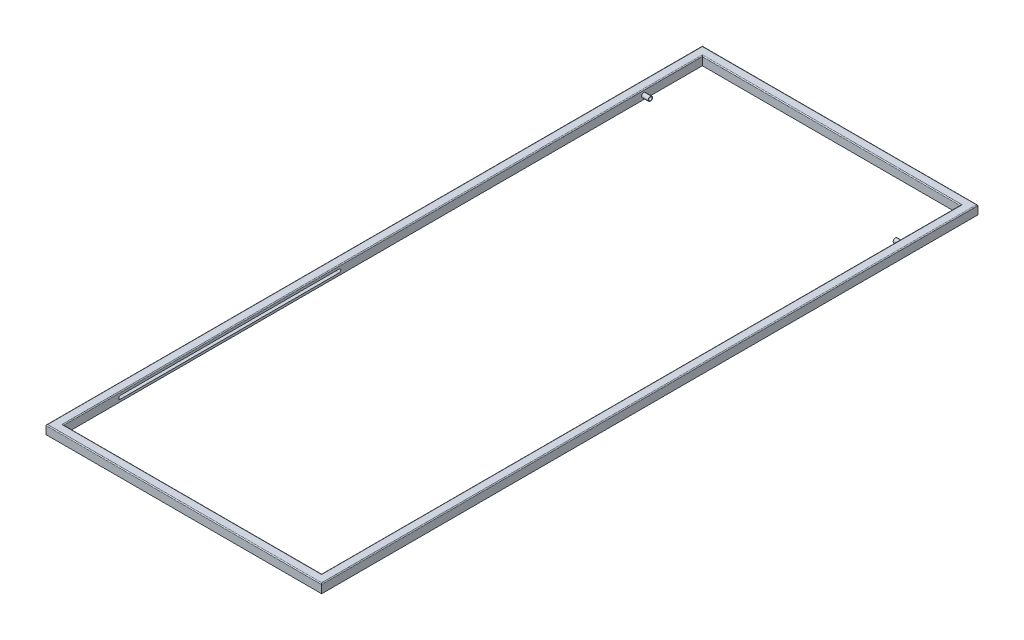
ISO-10303-21;
HEADER;
FILE_DESCRIPTION(('STEP AP214'),'2;1');
FILE_NAME('part.step','',(''),(''),'','','');
FILE_SCHEMA(('AUTOMOTIVE_DESIGN { 1 0 10303 214 1 1 1 1 }'));
ENDSEC;
DATA;
#1=APPLICATION_CONTEXT('core data for automotive mechanical design processes');
#2=APPLICATION_PROTOCOL_DEFINITION('international standard','automotive_design',2000,#1);
#3=PRODUCT_CONTEXT('',#1,'mechanical');
#4=PRODUCT('Part','Part','',(#3));
#5=PRODUCT_RELATED_PRODUCT_CATEGORY('part','',(#4));
#6=PRODUCT_DEFINITION_FORMATION('','',#4);
#7=PRODUCT_DEFINITION_CONTEXT('part definition',#1,'design');
#8=PRODUCT_DEFINITION('design','',#6,#7);
#9=PRODUCT_DEFINITION_SHAPE('','',#8);
#10=(LENGTH_UNIT() NAMED_UNIT(*) SI_UNIT(.MILLI.,.METRE.));
#11=(NAMED_UNIT(*) PLANE_ANGLE_UNIT() SI_UNIT($,.RADIAN.));
#12=(NAMED_UNIT(*) SI_UNIT($,.STERADIAN.) SOLID_ANGLE_UNIT());
#13=UNCERTAINTY_MEASURE_WITH_UNIT(LENGTH_MEASURE(1.E-05),#10,'distance_accuracy_value','');
#14=(GEOMETRIC_REPRESENTATION_CONTEXT(3) GLOBAL_UNCERTAINTY_ASSIGNED_CONTEXT((#13)) GLOBAL_UNIT_ASSIGNED_CONTEXT((#10,
#11,#12)) REPRESENTATION_CONTEXT('',''));
#15=CARTESIAN_POINT('',(0.,0.,0.));
#16=DIRECTION('',(0.,0.,1.));
#17=DIRECTION('',(1.,0.,0.));
#18=AXIS2_PLACEMENT_3D('',#15,#16,#17);
#19=CARTESIAN_POINT('',(0.,26.,0.));
#20=DIRECTION('',(0.,-1.,0.));
#21=DIRECTION('',(0.,0.,-1.));
#22=AXIS2_PLACEMENT_3D('',#19,#20,#21);
#23=PLANE('',#22);
#24=DIRECTION('',(0.,0.,1.));
#25=VECTOR('',#24,1.);
#26=CARTESIAN_POINT('',(-386.1,26.,-949.));
#27=LINE('',#26,#25);
#28=CARTESIAN_POINT('',(-386.1,26.,951.6));
#29=VERTEX_POINT('',#28);
#30=CARTESIAN_POINT('',(-386.1,26.,-951.6));
#31=VERTEX_POINT('',#30);
#32=EDGE_CURVE('E364',#29,#31,#27,.F.);
#33=ORIENTED_EDGE('',*,*,#32,.T.);
#34=DIRECTION('',(-1.,0.,0.));
#35=VECTOR('',#34,1.);
#36=CARTESIAN_POINT('',(383.5,26.,-951.6));
#37=LINE('',#36,#35);
#38=CARTESIAN_POINT('',(386.1,26.,-951.6));
#39=VERTEX_POINT('',#38);
#40=EDGE_CURVE('E373',#31,#39,#37,.F.);
#41=ORIENTED_EDGE('',*,*,#40,.T.);
#42=DIRECTION('',(0.,0.,-1.));
#43=VECTOR('',#42,1.);
#44=CARTESIAN_POINT('',(386.1,26.,949.));
#45=LINE('',#44,#43);
#46=CARTESIAN_POINT('',(386.1,26.,951.6));
#47=VERTEX_POINT('',#46);
#48=EDGE_CURVE('E370',#39,#47,#45,.F.);
#49=ORIENTED_EDGE('',*,*,#48,.T.);
#50=DIRECTION('',(1.,0.,0.));
#51=VECTOR('',#50,1.);
#52=CARTESIAN_POINT('',(-383.5,26.,951.6));
#53=LINE('',#52,#51);
#54=EDGE_CURVE('E367',#47,#29,#53,.F.);
#55=ORIENTED_EDGE('',*,*,#54,.T.);
#56=EDGE_LOOP('',(#33,#41,#49,#55));
#57=FACE_BOUND('',#56,.T.);
#58=DIRECTION('',(0.,0.,-1.));
#59=VECTOR('',#58,1.);
#60=CARTESIAN_POINT('',(406.9,26.,0.));
#61=LINE('',#60,#59);
#62=CARTESIAN_POINT('',(406.9,26.,972.4));
#63=VERTEX_POINT('',#62);
#64=CARTESIAN_POINT('',(406.9,26.,-972.4));
#65=VERTEX_POINT('',#64);
#66=EDGE_CURVE('E357',#63,#65,#61,.T.);
#67=ORIENTED_EDGE('',*,*,#66,.T.);
#68=DIRECTION('',(-1.,0.,0.));
#69=VECTOR('',#68,1.);
#70=CARTESIAN_POINT('',(0.,26.,-972.4));
#71=LINE('',#70,#69);
#72=CARTESIAN_POINT('',(-406.9,26.,-972.4));
#73=VERTEX_POINT('',#72);
#74=EDGE_CURVE('E360',#65,#73,#71,.T.);
#75=ORIENTED_EDGE('',*,*,#74,.T.);
#76=DIRECTION('',(0.,0.,1.));
#77=VECTOR('',#76,1.);
#78=CARTESIAN_POINT('',(-406.9,26.,0.));
#79=LINE('',#78,#77);
#80=CARTESIAN_POINT('',(-406.9,26.,972.4));
#81=VERTEX_POINT('',#80);
#82=EDGE_CURVE('E351',#73,#81,#79,.T.);
#83=ORIENTED_EDGE('',*,*,#82,.T.);
#84=DIRECTION('',(1.,0.,0.));
#85=VECTOR('',#84,1.);
#86=CARTESIAN_POINT('',(0.,26.,972.4));
#87=LINE('',#86,#85);
#88=EDGE_CURVE('E354',#81,#63,#87,.T.);
#89=ORIENTED_EDGE('',*,*,#88,.T.);
#90=EDGE_LOOP('',(#67,#75,#83,#89));
#91=FACE_BOUND('',#90,.T.);
#92=ADVANCED_FACE('F39',(#57,#91),#23,.F.);
#93=CARTESIAN_POINT('',(0.,0.,0.));
#94=DIRECTION('',(0.,-1.,0.));
#95=DIRECTION('',(0.,0.,-1.));
#96=AXIS2_PLACEMENT_3D('',#93,#94,#95);
#97=PLANE('',#96);
#98=CARTESIAN_POINT('',(-396.5,0.,-962.));
#99=DIRECTION('',(0.,-1.,0.));
#100=DIRECTION('',(0.,0.,1.));
#101=AXIS2_PLACEMENT_3D('',#98,#99,#100);
#102=CIRCLE('',#101,6.49999999999999);
#103=CARTESIAN_POINT('',(-396.5,0.,-955.5));
#104=VERTEX_POINT('',#103);
#105=EDGE_CURVE('E279',#104,#104,#102,.T.);
#106=ORIENTED_EDGE('',*,*,#105,.F.);
#107=EDGE_LOOP('',(#106));
#108=FACE_BOUND('',#107,.T.);
#109=CARTESIAN_POINT('',(396.5,0.,-962.));
#110=DIRECTION('',(0.,-1.,0.));
#111=DIRECTION('',(0.,0.,-1.));
#112=AXIS2_PLACEMENT_3D('',#109,#110,#111);
#113=CIRCLE('',#112,6.49999999999999);
#114=CARTESIAN_POINT('',(396.5,0.,-968.5));
#115=VERTEX_POINT('',#114);
#116=EDGE_CURVE('E271',#115,#115,#113,.T.);
#117=ORIENTED_EDGE('',*,*,#116,.F.);
#118=EDGE_LOOP('',(#117));
#119=FACE_BOUND('',#118,.T.);
#120=CARTESIAN_POINT('',(396.5,0.,962.));
#121=DIRECTION('',(0.,-1.,0.));
#122=DIRECTION('',(0.,0.,1.));
#123=AXIS2_PLACEMENT_3D('',#120,#121,#122);
#124=CIRCLE('',#123,6.49999999999999);
#125=CARTESIAN_POINT('',(396.5,0.,968.5));
#126=VERTEX_POINT('',#125);
#127=EDGE_CURVE('E263',#126,#126,#124,.T.);
#128=ORIENTED_EDGE('',*,*,#127,.F.);
#129=EDGE_LOOP('',(#128));
#130=FACE_BOUND('',#129,.T.);
#131=CARTESIAN_POINT('',(-396.5,0.,962.));
#132=DIRECTION('',(0.,-1.,0.));
#133=DIRECTION('',(0.,0.,-1.));
#134=AXIS2_PLACEMENT_3D('',#131,#132,#133);
#135=CIRCLE('',#134,6.49999999999999);
#136=CARTESIAN_POINT('',(-396.5,0.,955.5));
#137=VERTEX_POINT('',#136);
#138=EDGE_CURVE('E262',#137,#137,#135,.T.);
#139=ORIENTED_EDGE('',*,*,#138,.F.);
#140=EDGE_LOOP('',(#139));
#141=FACE_BOUND('',#140,.T.);
#142=DIRECTION('',(0.,0.,-1.));
#143=VECTOR('',#142,1.);
#144=CARTESIAN_POINT('',(409.5,0.,975.));
#145=LINE('',#144,#143);
#146=CARTESIAN_POINT('',(409.5,0.,975.));
#147=VERTEX_POINT('',#146);
#148=CARTESIAN_POINT('',(409.5,0.,-975.));
#149=VERTEX_POINT('',#148);
#150=EDGE_CURVE('E319',#147,#149,#145,.T.);
#151=ORIENTED_EDGE('',*,*,#150,.F.);
#152=DIRECTION('',(1.,0.,0.));
#153=VECTOR('',#152,1.);
#154=CARTESIAN_POINT('',(-409.5,0.,975.));
#155=LINE('',#154,#153);
#156=CARTESIAN_POINT('',(-409.5,0.,975.));
#157=VERTEX_POINT('',#156);
#158=EDGE_CURVE('E331',#157,#147,#155,.T.);
#159=ORIENTED_EDGE('',*,*,#158,.F.);
#160=DIRECTION('',(0.,0.,1.));
#161=VECTOR('',#160,1.);
#162=CARTESIAN_POINT('',(-409.5,0.,975.));
#163=LINE('',#162,#161);
#164=CARTESIAN_POINT('',(-409.5,0.,-975.));
#165=VERTEX_POINT('',#164);
#166=EDGE_CURVE('E327',#165,#157,#163,.T.);
#167=ORIENTED_EDGE('',*,*,#166,.F.);
#168=DIRECTION('',(-1.,0.,0.));
#169=VECTOR('',#168,1.);
#170=CARTESIAN_POINT('',(-409.5,0.,-975.));
#171=LINE('',#170,#169);
#172=EDGE_CURVE('E323',#149,#165,#171,.T.);
#173=ORIENTED_EDGE('',*,*,#172,.F.);
#174=EDGE_LOOP('',(#151,#159,#167,#173));
#175=FACE_BOUND('',#174,.T.);
#176=DIRECTION('',(1.,0.,0.));
#177=VECTOR('',#176,1.);
#178=CARTESIAN_POINT('',(-383.5,0.,949.));
#179=LINE('',#178,#177);
#180=CARTESIAN_POINT('',(-383.5,0.,949.));
#181=VERTEX_POINT('',#180);
#182=CARTESIAN_POINT('',(383.5,0.,949.));
#183=VERTEX_POINT('',#182);
#184=EDGE_CURVE('E303',#181,#183,#179,.T.);
#185=ORIENTED_EDGE('',*,*,#184,.T.);
#186=DIRECTION('',(0.,0.,-1.));
#187=VECTOR('',#186,1.);
#188=CARTESIAN_POINT('',(383.5,0.,949.));
#189=LINE('',#188,#187);
#190=CARTESIAN_POINT('',(383.5,0.,-949.));
#191=VERTEX_POINT('',#190);
#192=EDGE_CURVE('E288',#183,#191,#189,.T.);
#193=ORIENTED_EDGE('',*,*,#192,.T.);
#194=DIRECTION('',(-1.,0.,0.));
#195=VECTOR('',#194,1.);
#196=CARTESIAN_POINT('',(-383.5,0.,-949.));
#197=LINE('',#196,#195);
#198=CARTESIAN_POINT('',(-383.5,0.,-949.));
#199=VERTEX_POINT('',#198);
#200=EDGE_CURVE('E295',#191,#199,#197,.T.);
#201=ORIENTED_EDGE('',*,*,#200,.T.);
#202=DIRECTION('',(0.,0.,1.));
#203=VECTOR('',#202,1.);
#204=CARTESIAN_POINT('',(-383.5,0.,949.));
#205=LINE('',#204,#203);
#206=EDGE_CURVE('E299',#199,#181,#205,.T.);
#207=ORIENTED_EDGE('',*,*,#206,.T.);
#208=EDGE_LOOP('',(#185,#193,#201,#207));
#209=FACE_BOUND('',#208,.T.);
#210=ADVANCED_FACE('F466',(#108,#119,#130,#141,#175,#209),#97,.T.);
#211=CARTESIAN_POINT('',(409.5,26.,975.));
#212=DIRECTION('',(-1.,0.,0.));
#213=DIRECTION('',(0.,0.,1.));
#214=AXIS2_PLACEMENT_3D('',#211,#212,#213);
#215=PLANE('',#214);
#216=DIRECTION('',(0.,-1.,0.));
#217=VECTOR('',#216,1.);
#218=CARTESIAN_POINT('',(409.5,26.,-975.));
#219=LINE('',#218,#217);
#220=CARTESIAN_POINT('',(409.5,23.4,-975.));
#221=VERTEX_POINT('',#220);
#222=EDGE_CURVE('E344',#221,#149,#219,.T.);
#223=ORIENTED_EDGE('',*,*,#222,.F.);
#224=DIRECTION('',(0.,0.,-1.));
#225=VECTOR('',#224,1.);
#226=CARTESIAN_POINT('',(409.5,23.4,975.));
#227=LINE('',#226,#225);
#228=CARTESIAN_POINT('',(409.5,23.4,975.));
#229=VERTEX_POINT('',#228);
#230=EDGE_CURVE('E384',#221,#229,#227,.F.);
#231=ORIENTED_EDGE('',*,*,#230,.T.);
#232=DIRECTION('',(0.,-1.,0.));
#233=VECTOR('',#232,1.);
#234=CARTESIAN_POINT('',(409.5,26.,975.));
#235=LINE('',#234,#233);
#236=EDGE_CURVE('E335',#229,#147,#235,.T.);
#237=ORIENTED_EDGE('',*,*,#236,.T.);
#238=ORIENTED_EDGE('',*,*,#150,.T.);
#239=EDGE_LOOP('',(#223,#231,#237,#238));
#240=FACE_BOUND('',#239,.T.);
#241=ADVANCED_FACE('F471',(#240),#215,.F.);
#242=CARTESIAN_POINT('',(-409.5,26.,-975.));
#243=DIRECTION('',(0.,0.,1.));
#244=DIRECTION('',(1.,0.,0.));
#245=AXIS2_PLACEMENT_3D('',#242,#243,#244);
#246=PLANE('',#245);
#247=DIRECTION('',(0.,-1.,0.));
#248=VECTOR('',#247,1.);
#249=CARTESIAN_POINT('',(-409.5,26.,-975.));
#250=LINE('',#249,#248);
#251=CARTESIAN_POINT('',(-409.5,23.4,-975.));
#252=VERTEX_POINT('',#251);
#253=EDGE_CURVE('E341',#252,#165,#250,.T.);
#254=ORIENTED_EDGE('',*,*,#253,.F.);
#255=DIRECTION('',(-1.,0.,0.));
#256=VECTOR('',#255,1.);
#257=CARTESIAN_POINT('',(-409.5,23.4,-975.));
#258=LINE('',#257,#256);
#259=EDGE_CURVE('E377',#252,#221,#258,.F.);
#260=ORIENTED_EDGE('',*,*,#259,.T.);
#261=ORIENTED_EDGE('',*,*,#222,.T.);
#262=ORIENTED_EDGE('',*,*,#172,.T.);
#263=EDGE_LOOP('',(#254,#260,#261,#262));
#264=FACE_BOUND('',#263,.T.);
#265=ADVANCED_FACE('F482',(#264),#246,.F.);
#266=CARTESIAN_POINT('',(-409.5,26.,975.));
#267=DIRECTION('',(1.,0.,0.));
#268=DIRECTION('',(0.,0.,-1.));
#269=AXIS2_PLACEMENT_3D('',#266,#267,#268);
#270=PLANE('',#269);
#271=DIRECTION('',(0.,-1.,0.));
#272=VECTOR('',#271,1.);
#273=CARTESIAN_POINT('',(-409.5,26.,975.));
#274=LINE('',#273,#272);
#275=CARTESIAN_POINT('',(-409.5,23.4,975.));
#276=VERTEX_POINT('',#275);
#277=EDGE_CURVE('E338',#276,#157,#274,.T.);
#278=ORIENTED_EDGE('',*,*,#277,.F.);
#279=DIRECTION('',(0.,0.,1.));
#280=VECTOR('',#279,1.);
#281=CARTESIAN_POINT('',(-409.5,23.4,975.));
#282=LINE('',#281,#280);
#283=EDGE_CURVE('E396',#276,#252,#282,.F.);
#284=ORIENTED_EDGE('',*,*,#283,.T.);
#285=ORIENTED_EDGE('',*,*,#253,.T.);
#286=ORIENTED_EDGE('',*,*,#166,.T.);
#287=EDGE_LOOP('',(#278,#284,#285,#286));
#288=FACE_BOUND('',#287,.T.);
#289=ADVANCED_FACE('F478',(#288),#270,.F.);
#290=CARTESIAN_POINT('',(-409.5,26.,975.));
#291=DIRECTION('',(0.,0.,-1.));
#292=DIRECTION('',(-1.,0.,0.));
#293=AXIS2_PLACEMENT_3D('',#290,#291,#292);
#294=PLANE('',#293);
#295=ORIENTED_EDGE('',*,*,#236,.F.);
#296=DIRECTION('',(1.,0.,0.));
#297=VECTOR('',#296,1.);
#298=CARTESIAN_POINT('',(-409.5,23.4,975.));
#299=LINE('',#298,#297);
#300=EDGE_CURVE('E390',#229,#276,#299,.F.);
#301=ORIENTED_EDGE('',*,*,#300,.T.);
#302=ORIENTED_EDGE('',*,*,#277,.T.);
#303=ORIENTED_EDGE('',*,*,#158,.T.);
#304=EDGE_LOOP('',(#295,#301,#302,#303));
#305=FACE_BOUND('',#304,.T.);
#306=ADVANCED_FACE('F463',(#305),#294,.F.);
#307=CARTESIAN_POINT('',(383.5,26.,949.));
#308=DIRECTION('',(-1.,0.,0.));
#309=DIRECTION('',(0.,0.,1.));
#310=AXIS2_PLACEMENT_3D('',#307,#308,#309);
#311=PLANE('',#310);
#312=CARTESIAN_POINT('',(383.5,11.7,-775.125));
#313=DIRECTION('',(-1.,0.,0.));
#314=DIRECTION('',(0.,0.,1.));
#315=AXIS2_PLACEMENT_3D('',#312,#313,#314);
#316=CIRCLE('',#315,6.50000000000006);
#317=CARTESIAN_POINT('',(383.5,11.7,-768.625));
#318=VERTEX_POINT('',#317);
#319=EDGE_CURVE('E210',#318,#318,#316,.T.);
#320=ORIENTED_EDGE('',*,*,#319,.F.);
#321=EDGE_LOOP('',(#320));
#322=FACE_BOUND('',#321,.T.);
#323=CARTESIAN_POINT('',(383.5,11.7,780.));
#324=DIRECTION('',(-1.,0.,0.));
#325=DIRECTION('',(0.,0.,1.));
#326=AXIS2_PLACEMENT_3D('',#323,#324,#325);
#327=CIRCLE('',#326,4.875);
#328=CARTESIAN_POINT('',(383.5,6.825,780.));
#329=VERTEX_POINT('',#328);
#330=CARTESIAN_POINT('',(383.5,16.575,780.));
#331=VERTEX_POINT('',#330);
#332=EDGE_CURVE('E185',#329,#331,#327,.T.);
#333=ORIENTED_EDGE('',*,*,#332,.F.);
#334=DIRECTION('',(0.,0.,-1.));
#335=VECTOR('',#334,1.);
#336=CARTESIAN_POINT('',(383.5,6.825,949.));
#337=LINE('',#336,#335);
#338=CARTESIAN_POINT('',(383.5,6.825,130.));
#339=VERTEX_POINT('',#338);
#340=EDGE_CURVE('E244',#329,#339,#337,.T.);
#341=ORIENTED_EDGE('',*,*,#340,.T.);
#342=CARTESIAN_POINT('',(383.5,11.6999999999999,130.));
#343=DIRECTION('',(-1.,0.,0.));
#344=DIRECTION('',(0.,0.,1.));
#345=AXIS2_PLACEMENT_3D('',#342,#343,#344);
#346=CIRCLE('',#345,4.875);
#347=CARTESIAN_POINT('',(383.5,16.575,130.));
#348=VERTEX_POINT('',#347);
#349=EDGE_CURVE('E248',#339,#348,#346,.F.);
#350=ORIENTED_EDGE('',*,*,#349,.T.);
#351=DIRECTION('',(0.,0.,-1.));
#352=VECTOR('',#351,1.);
#353=CARTESIAN_POINT('',(383.5,16.575,949.));
#354=LINE('',#353,#352);
#355=EDGE_CURVE('E252',#331,#348,#354,.T.);
#356=ORIENTED_EDGE('',*,*,#355,.F.);
#357=EDGE_LOOP('',(#333,#341,#350,#356));
#358=FACE_BOUND('',#357,.T.);
#359=DIRECTION('',(0.,-1.,0.));
#360=VECTOR('',#359,1.);
#361=CARTESIAN_POINT('',(383.5,26.,949.));
#362=LINE('',#361,#360);
#363=CARTESIAN_POINT('',(383.5,23.4,949.));
#364=VERTEX_POINT('',#363);
#365=EDGE_CURVE('E307',#364,#183,#362,.T.);
#366=ORIENTED_EDGE('',*,*,#365,.F.);
#367=DIRECTION('',(0.,0.,-1.));
#368=VECTOR('',#367,1.);
#369=CARTESIAN_POINT('',(383.5,23.4,-949.));
#370=LINE('',#369,#368);
#371=CARTESIAN_POINT('',(383.5,23.4,-949.));
#372=VERTEX_POINT('',#371);
#373=EDGE_CURVE('E381',#364,#372,#370,.T.);
#374=ORIENTED_EDGE('',*,*,#373,.T.);
#375=DIRECTION('',(0.,-1.,0.));
#376=VECTOR('',#375,1.);
#377=CARTESIAN_POINT('',(383.5,26.,-949.));
#378=LINE('',#377,#376);
#379=EDGE_CURVE('E316',#372,#191,#378,.T.);
#380=ORIENTED_EDGE('',*,*,#379,.T.);
#381=ORIENTED_EDGE('',*,*,#192,.F.);
#382=EDGE_LOOP('',(#366,#374,#380,#381));
#383=FACE_BOUND('',#382,.T.);
#384=ADVANCED_FACE('F448',(#322,#358,#383),#311,.T.);
#385=CARTESIAN_POINT('',(-383.5,26.,-949.));
#386=DIRECTION('',(0.,0.,1.));
#387=DIRECTION('',(1.,0.,0.));
#388=AXIS2_PLACEMENT_3D('',#385,#386,#387);
#389=PLANE('',#388);
#390=ORIENTED_EDGE('',*,*,#379,.F.);
#391=DIRECTION('',(-1.,0.,0.));
#392=VECTOR('',#391,1.);
#393=CARTESIAN_POINT('',(-383.5,23.4,-949.));
#394=LINE('',#393,#392);
#395=CARTESIAN_POINT('',(-383.5,23.4,-949.));
#396=VERTEX_POINT('',#395);
#397=EDGE_CURVE('E347',#372,#396,#394,.T.);
#398=ORIENTED_EDGE('',*,*,#397,.T.);
#399=DIRECTION('',(0.,-1.,0.));
#400=VECTOR('',#399,1.);
#401=CARTESIAN_POINT('',(-383.5,26.,-949.));
#402=LINE('',#401,#400);
#403=EDGE_CURVE('E313',#396,#199,#402,.T.);
#404=ORIENTED_EDGE('',*,*,#403,.T.);
#405=ORIENTED_EDGE('',*,*,#200,.F.);
#406=EDGE_LOOP('',(#390,#398,#404,#405));
#407=FACE_BOUND('',#406,.T.);
#408=ADVANCED_FACE('F462',(#407),#389,.T.);
#409=CARTESIAN_POINT('',(-383.5,26.,949.));
#410=DIRECTION('',(1.,0.,0.));
#411=DIRECTION('',(0.,0.,-1.));
#412=AXIS2_PLACEMENT_3D('',#409,#410,#411);
#413=PLANE('',#412);
#414=CARTESIAN_POINT('',(-383.5,11.7,-775.125));
#415=DIRECTION('',(1.,0.,0.));
#416=DIRECTION('',(0.,0.,-1.));
#417=AXIS2_PLACEMENT_3D('',#414,#415,#416);
#418=CIRCLE('',#417,6.50000000000006);
#419=CARTESIAN_POINT('',(-383.5,11.7,-781.625));
#420=VERTEX_POINT('',#419);
#421=EDGE_CURVE('E11',#420,#420,#418,.T.);
#422=ORIENTED_EDGE('',*,*,#421,.F.);
#423=EDGE_LOOP('',(#422));
#424=FACE_BOUND('',#423,.T.);
#425=CARTESIAN_POINT('',(-383.5,11.7,780.));
#426=DIRECTION('',(1.,0.,0.));
#427=DIRECTION('',(0.,0.,-1.));
#428=AXIS2_PLACEMENT_3D('',#425,#426,#427);
#429=CIRCLE('',#428,4.875);
#430=CARTESIAN_POINT('',(-383.5,16.575,780.));
#431=VERTEX_POINT('',#430);
#432=CARTESIAN_POINT('',(-383.5,6.825,780.));
#433=VERTEX_POINT('',#432);
#434=EDGE_CURVE('E436',#431,#433,#429,.T.);
#435=ORIENTED_EDGE('',*,*,#434,.F.);
#436=DIRECTION('',(0.,0.,1.));
#437=VECTOR('',#436,1.);
#438=CARTESIAN_POINT('',(-383.5,16.575,949.));
#439=LINE('',#438,#437);
#440=CARTESIAN_POINT('',(-383.5,16.575,130.));
#441=VERTEX_POINT('',#440);
#442=EDGE_CURVE('E433',#441,#431,#439,.T.);
#443=ORIENTED_EDGE('',*,*,#442,.F.);
#444=CARTESIAN_POINT('',(-383.5,11.6999999999999,130.));
#445=DIRECTION('',(1.,0.,0.));
#446=DIRECTION('',(0.,0.,-1.));
#447=AXIS2_PLACEMENT_3D('',#444,#445,#446);
#448=CIRCLE('',#447,4.875);
#449=CARTESIAN_POINT('',(-383.5,6.825,130.));
#450=VERTEX_POINT('',#449);
#451=EDGE_CURVE('E429',#441,#450,#448,.F.);
#452=ORIENTED_EDGE('',*,*,#451,.T.);
#453=DIRECTION('',(0.,0.,1.));
#454=VECTOR('',#453,1.);
#455=CARTESIAN_POINT('',(-383.5,6.825,949.));
#456=LINE('',#455,#454);
#457=EDGE_CURVE('E399',#450,#433,#456,.T.);
#458=ORIENTED_EDGE('',*,*,#457,.T.);
#459=EDGE_LOOP('',(#435,#443,#452,#458));
#460=FACE_BOUND('',#459,.T.);
#461=ORIENTED_EDGE('',*,*,#403,.F.);
#462=DIRECTION('',(0.,0.,1.));
#463=VECTOR('',#462,1.);
#464=CARTESIAN_POINT('',(-383.5,23.4,949.));
#465=LINE('',#464,#463);
#466=CARTESIAN_POINT('',(-383.5,23.4,949.));
#467=VERTEX_POINT('',#466);
#468=EDGE_CURVE('E393',#396,#467,#465,.T.);
#469=ORIENTED_EDGE('',*,*,#468,.T.);
#470=DIRECTION('',(0.,-1.,0.));
#471=VECTOR('',#470,1.);
#472=CARTESIAN_POINT('',(-383.5,26.,949.));
#473=LINE('',#472,#471);
#474=EDGE_CURVE('E310',#467,#181,#473,.T.);
#475=ORIENTED_EDGE('',*,*,#474,.T.);
#476=ORIENTED_EDGE('',*,*,#206,.F.);
#477=EDGE_LOOP('',(#461,#469,#475,#476));
#478=FACE_BOUND('',#477,.T.);
#479=ADVANCED_FACE('F562',(#424,#460,#478),#413,.T.);
#480=CARTESIAN_POINT('',(-383.5,26.,949.));
#481=DIRECTION('',(0.,0.,-1.));
#482=DIRECTION('',(-1.,0.,0.));
#483=AXIS2_PLACEMENT_3D('',#480,#481,#482);
#484=PLANE('',#483);
#485=ORIENTED_EDGE('',*,*,#474,.F.);
#486=DIRECTION('',(1.,0.,0.));
#487=VECTOR('',#486,1.);
#488=CARTESIAN_POINT('',(383.5,23.4,949.));
#489=LINE('',#488,#487);
#490=EDGE_CURVE('E387',#467,#364,#489,.T.);
#491=ORIENTED_EDGE('',*,*,#490,.T.);
#492=ORIENTED_EDGE('',*,*,#365,.T.);
#493=ORIENTED_EDGE('',*,*,#184,.F.);
#494=EDGE_LOOP('',(#485,#491,#492,#493));
#495=FACE_BOUND('',#494,.T.);
#496=ADVANCED_FACE('F549',(#495),#484,.T.);
#497=CARTESIAN_POINT('',(-396.5,19.5,962.));
#498=DIRECTION('',(0.,-1.,0.));
#499=DIRECTION('',(0.,0.,-1.));
#500=AXIS2_PLACEMENT_3D('',#497,#498,#499);
#501=CYLINDRICAL_SURFACE('',#500,6.49999999999999);
#502=CARTESIAN_POINT('',(-396.5,19.5,962.));
#503=DIRECTION('',(0.,-1.,0.));
#504=DIRECTION('',(0.,0.,-1.));
#505=AXIS2_PLACEMENT_3D('',#502,#503,#504);
#506=CIRCLE('',#505,6.49999999999999);
#507=CARTESIAN_POINT('',(-396.5,19.5,955.5));
#508=VERTEX_POINT('',#507);
#509=EDGE_CURVE('E284',#508,#508,#506,.T.);
#510=ORIENTED_EDGE('',*,*,#509,.F.);
#511=EDGE_LOOP('',(#510));
#512=FACE_BOUND('',#511,.T.);
#513=ORIENTED_EDGE('',*,*,#138,.T.);
#514=EDGE_LOOP('',(#513));
#515=FACE_BOUND('',#514,.T.);
#516=ADVANCED_FACE('F578',(#512,#515),#501,.F.);
#517=CARTESIAN_POINT('',(-396.5,19.5,962.));
#518=DIRECTION('',(0.,-1.,0.));
#519=DIRECTION('',(0.,0.,-1.));
#520=AXIS2_PLACEMENT_3D('',#517,#518,#519);
#521=PLANE('',#520);
#522=ORIENTED_EDGE('',*,*,#509,.T.);
#523=EDGE_LOOP('',(#522));
#524=FACE_BOUND('',#523,.T.);
#525=ADVANCED_FACE('F671',(#524),#521,.T.);
#526=CARTESIAN_POINT('',(396.5,19.5,962.));
#527=DIRECTION('',(0.,-1.,0.));
#528=DIRECTION('',(0.,0.,-1.));
#529=AXIS2_PLACEMENT_3D('',#526,#527,#528);
#530=CYLINDRICAL_SURFACE('',#529,6.49999999999999);
#531=CARTESIAN_POINT('',(396.5,19.5,962.));
#532=DIRECTION('',(0.,-1.,0.));
#533=DIRECTION('',(0.,0.,1.));
#534=AXIS2_PLACEMENT_3D('',#531,#532,#533);
#535=CIRCLE('',#534,6.49999999999999);
#536=CARTESIAN_POINT('',(396.5,19.5,968.5));
#537=VERTEX_POINT('',#536);
#538=EDGE_CURVE('E258',#537,#537,#535,.T.);
#539=ORIENTED_EDGE('',*,*,#538,.F.);
#540=EDGE_LOOP('',(#539));
#541=FACE_BOUND('',#540,.T.);
#542=ORIENTED_EDGE('',*,*,#127,.T.);
#543=EDGE_LOOP('',(#542));
#544=FACE_BOUND('',#543,.T.);
#545=ADVANCED_FACE('F667',(#541,#544),#530,.F.);
#546=CARTESIAN_POINT('',(396.5,19.5,962.));
#547=DIRECTION('',(0.,1.,0.));
#548=DIRECTION('',(0.,0.,1.));
#549=AXIS2_PLACEMENT_3D('',#546,#547,#548);
#550=PLANE('',#549);
#551=ORIENTED_EDGE('',*,*,#538,.T.);
#552=EDGE_LOOP('',(#551));
#553=FACE_BOUND('',#552,.T.);
#554=ADVANCED_FACE('F663',(#553),#550,.F.);
#555=CARTESIAN_POINT('',(396.5,19.5,-962.));
#556=DIRECTION('',(0.,-1.,0.));
#557=DIRECTION('',(0.,0.,-1.));
#558=AXIS2_PLACEMENT_3D('',#555,#556,#557);
#559=CYLINDRICAL_SURFACE('',#558,6.49999999999999);
#560=CARTESIAN_POINT('',(396.5,19.5,-962.));
#561=DIRECTION('',(0.,-1.,0.));
#562=DIRECTION('',(0.,0.,-1.));
#563=AXIS2_PLACEMENT_3D('',#560,#561,#562);
#564=CIRCLE('',#563,6.49999999999999);
#565=CARTESIAN_POINT('',(396.5,19.5,-968.5));
#566=VERTEX_POINT('',#565);
#567=EDGE_CURVE('E267',#566,#566,#564,.T.);
#568=ORIENTED_EDGE('',*,*,#567,.F.);
#569=EDGE_LOOP('',(#568));
#570=FACE_BOUND('',#569,.T.);
#571=ORIENTED_EDGE('',*,*,#116,.T.);
#572=EDGE_LOOP('',(#571));
#573=FACE_BOUND('',#572,.T.);
#574=ADVANCED_FACE('F666',(#570,#573),#559,.F.);
#575=CARTESIAN_POINT('',(396.5,19.5,-962.));
#576=DIRECTION('',(0.,-1.,0.));
#577=DIRECTION('',(0.,0.,-1.));
#578=AXIS2_PLACEMENT_3D('',#575,#576,#577);
#579=PLANE('',#578);
#580=ORIENTED_EDGE('',*,*,#567,.T.);
#581=EDGE_LOOP('',(#580));
#582=FACE_BOUND('',#581,.T.);
#583=ADVANCED_FACE('F673',(#582),#579,.T.);
#584=CARTESIAN_POINT('',(-396.5,19.5,-962.));
#585=DIRECTION('',(0.,-1.,0.));
#586=DIRECTION('',(0.,0.,-1.));
#587=AXIS2_PLACEMENT_3D('',#584,#585,#586);
#588=CYLINDRICAL_SURFACE('',#587,6.49999999999999);
#589=CARTESIAN_POINT('',(-396.5,19.5,-962.));
#590=DIRECTION('',(0.,-1.,0.));
#591=DIRECTION('',(0.,0.,1.));
#592=AXIS2_PLACEMENT_3D('',#589,#590,#591);
#593=CIRCLE('',#592,6.49999999999999);
#594=CARTESIAN_POINT('',(-396.5,19.5,-955.5));
#595=VERTEX_POINT('',#594);
#596=EDGE_CURVE('E275',#595,#595,#593,.T.);
#597=ORIENTED_EDGE('',*,*,#596,.F.);
#598=EDGE_LOOP('',(#597));
#599=FACE_BOUND('',#598,.T.);
#600=ORIENTED_EDGE('',*,*,#105,.T.);
#601=EDGE_LOOP('',(#600));
#602=FACE_BOUND('',#601,.T.);
#603=ADVANCED_FACE('F676',(#599,#602),#588,.F.);
#604=CARTESIAN_POINT('',(-396.5,19.5,-962.));
#605=DIRECTION('',(0.,1.,0.));
#606=DIRECTION('',(0.,0.,1.));
#607=AXIS2_PLACEMENT_3D('',#604,#605,#606);
#608=PLANE('',#607);
#609=ORIENTED_EDGE('',*,*,#596,.T.);
#610=EDGE_LOOP('',(#609));
#611=FACE_BOUND('',#610,.T.);
#612=ADVANCED_FACE('F505',(#611),#608,.F.);
#613=CARTESIAN_POINT('',(-383.5,23.4,951.6));
#614=DIRECTION('',(-1.,0.,0.));
#615=DIRECTION('',(0.,0.,1.));
#616=AXIS2_PLACEMENT_3D('',#613,#614,#615);
#617=CYLINDRICAL_SURFACE('',#616,2.6);
#618=CARTESIAN_POINT('',(-386.1,23.4,951.6));
#619=DIRECTION('',(-0.707106781186547,0.,-0.707106781186547));
#620=DIRECTION('',(-0.707106781186547,0.,0.707106781186547));
#621=AXIS2_PLACEMENT_3D('',#618,#619,#620);
#622=ELLIPSE('',#621,3.67695526217005,2.6);
#623=EDGE_CURVE('E407',#29,#467,#622,.T.);
#624=ORIENTED_EDGE('',*,*,#623,.F.);
#625=ORIENTED_EDGE('',*,*,#54,.F.);
#626=CARTESIAN_POINT('',(386.1,23.4,951.6));
#627=DIRECTION('',(-0.707106781186547,0.,0.707106781186547));
#628=DIRECTION('',(0.707106781186547,0.,0.707106781186547));
#629=AXIS2_PLACEMENT_3D('',#626,#627,#628);
#630=ELLIPSE('',#629,3.67695526217005,2.6);
#631=EDGE_CURVE('E283',#364,#47,#630,.F.);
#632=ORIENTED_EDGE('',*,*,#631,.F.);
#633=ORIENTED_EDGE('',*,*,#490,.F.);
#634=EDGE_LOOP('',(#624,#625,#632,#633));
#635=FACE_BOUND('',#634,.T.);
#636=ADVANCED_FACE('F501',(#635),#617,.T.);
#637=CARTESIAN_POINT('',(386.1,23.4,949.));
#638=DIRECTION('',(0.,0.,1.));
#639=DIRECTION('',(1.,0.,0.));
#640=AXIS2_PLACEMENT_3D('',#637,#638,#639);
#641=CYLINDRICAL_SURFACE('',#640,2.6);
#642=ORIENTED_EDGE('',*,*,#631,.T.);
#643=ORIENTED_EDGE('',*,*,#48,.F.);
#644=CARTESIAN_POINT('',(386.1,23.4,-951.6));
#645=DIRECTION('',(0.707106781186547,0.,0.707106781186547));
#646=DIRECTION('',(0.707106781186547,0.,-0.707106781186547));
#647=AXIS2_PLACEMENT_3D('',#644,#645,#646);
#648=ELLIPSE('',#647,3.67695526217005,2.6);
#649=EDGE_CURVE('E403',#372,#39,#648,.F.);
#650=ORIENTED_EDGE('',*,*,#649,.F.);
#651=ORIENTED_EDGE('',*,*,#373,.F.);
#652=EDGE_LOOP('',(#642,#643,#650,#651));
#653=FACE_BOUND('',#652,.T.);
#654=ADVANCED_FACE('F497',(#653),#641,.T.);
#655=CARTESIAN_POINT('',(-386.1,23.4,949.));
#656=DIRECTION('',(0.,0.,-1.));
#657=DIRECTION('',(-1.,0.,0.));
#658=AXIS2_PLACEMENT_3D('',#655,#656,#657);
#659=CYLINDRICAL_SURFACE('',#658,2.6);
#660=ORIENTED_EDGE('',*,*,#623,.T.);
#661=ORIENTED_EDGE('',*,*,#468,.F.);
#662=CARTESIAN_POINT('',(-386.1,23.4,-951.6));
#663=DIRECTION('',(0.707106781186547,0.,-0.707106781186547));
#664=DIRECTION('',(0.707106781186547,0.,0.707106781186547));
#665=AXIS2_PLACEMENT_3D('',#662,#663,#664);
#666=ELLIPSE('',#665,3.67695526217005,2.6);
#667=EDGE_CURVE('E400',#31,#396,#666,.T.);
#668=ORIENTED_EDGE('',*,*,#667,.F.);
#669=ORIENTED_EDGE('',*,*,#32,.F.);
#670=EDGE_LOOP('',(#660,#661,#668,#669));
#671=FACE_BOUND('',#670,.T.);
#672=ADVANCED_FACE('F493',(#671),#659,.T.);
#673=CARTESIAN_POINT('',(-383.5,23.4,-951.6));
#674=DIRECTION('',(1.,0.,0.));
#675=DIRECTION('',(0.,0.,-1.));
#676=AXIS2_PLACEMENT_3D('',#673,#674,#675);
#677=CYLINDRICAL_SURFACE('',#676,2.6);
#678=ORIENTED_EDGE('',*,*,#649,.T.);
#679=ORIENTED_EDGE('',*,*,#40,.F.);
#680=ORIENTED_EDGE('',*,*,#667,.T.);
#681=ORIENTED_EDGE('',*,*,#397,.F.);
#682=EDGE_LOOP('',(#678,#679,#680,#681));
#683=FACE_BOUND('',#682,.T.);
#684=ADVANCED_FACE('F490',(#683),#677,.T.);
#685=CARTESIAN_POINT('',(0.,23.4,972.4));
#686=DIRECTION('',(1.,0.,0.));
#687=DIRECTION('',(0.,0.,-1.));
#688=AXIS2_PLACEMENT_3D('',#685,#686,#687);
#689=CYLINDRICAL_SURFACE('',#688,2.6);
#690=CARTESIAN_POINT('',(-406.9,23.4,972.4));
#691=DIRECTION('',(0.707106781186547,0.,0.707106781186547));
#692=DIRECTION('',(-0.707106781186547,0.,0.707106781186547));
#693=AXIS2_PLACEMENT_3D('',#690,#691,#692);
#694=ELLIPSE('',#693,3.67695526217005,2.6);
#695=EDGE_CURVE('E419',#276,#81,#694,.F.);
#696=ORIENTED_EDGE('',*,*,#695,.F.);
#697=ORIENTED_EDGE('',*,*,#300,.F.);
#698=CARTESIAN_POINT('',(406.9,23.4,972.4));
#699=DIRECTION('',(0.707106781186547,0.,-0.707106781186547));
#700=DIRECTION('',(0.707106781186547,0.,0.707106781186547));
#701=AXIS2_PLACEMENT_3D('',#698,#699,#700);
#702=ELLIPSE('',#701,3.67695526217005,2.6);
#703=EDGE_CURVE('E404',#63,#229,#702,.T.);
#704=ORIENTED_EDGE('',*,*,#703,.F.);
#705=ORIENTED_EDGE('',*,*,#88,.F.);
#706=EDGE_LOOP('',(#696,#697,#704,#705));
#707=FACE_BOUND('',#706,.T.);
#708=ADVANCED_FACE('F41',(#707),#689,.T.);
#709=CARTESIAN_POINT('',(406.9,23.4,0.));
#710=DIRECTION('',(0.,0.,-1.));
#711=DIRECTION('',(-1.,0.,0.));
#712=AXIS2_PLACEMENT_3D('',#709,#710,#711);
#713=CYLINDRICAL_SURFACE('',#712,2.6);
#714=ORIENTED_EDGE('',*,*,#703,.T.);
#715=ORIENTED_EDGE('',*,*,#230,.F.);
#716=CARTESIAN_POINT('',(406.9,23.4,-972.4));
#717=DIRECTION('',(-0.707106781186547,0.,-0.707106781186547));
#718=DIRECTION('',(0.707106781186547,0.,-0.707106781186547));
#719=AXIS2_PLACEMENT_3D('',#716,#717,#718);
#720=ELLIPSE('',#719,3.67695526217005,2.6);
#721=EDGE_CURVE('E416',#65,#221,#720,.T.);
#722=ORIENTED_EDGE('',*,*,#721,.F.);
#723=ORIENTED_EDGE('',*,*,#66,.F.);
#724=EDGE_LOOP('',(#714,#715,#722,#723));
#725=FACE_BOUND('',#724,.T.);
#726=ADVANCED_FACE('F514',(#725),#713,.T.);
#727=CARTESIAN_POINT('',(-406.9,23.4,0.));
#728=DIRECTION('',(0.,0.,1.));
#729=DIRECTION('',(1.,0.,0.));
#730=AXIS2_PLACEMENT_3D('',#727,#728,#729);
#731=CYLINDRICAL_SURFACE('',#730,2.6);
#732=ORIENTED_EDGE('',*,*,#695,.T.);
#733=ORIENTED_EDGE('',*,*,#82,.F.);
#734=CARTESIAN_POINT('',(-406.9,23.4,-972.4));
#735=DIRECTION('',(-0.707106781186547,0.,0.707106781186547));
#736=DIRECTION('',(0.707106781186547,0.,0.707106781186547));
#737=AXIS2_PLACEMENT_3D('',#734,#735,#736);
#738=ELLIPSE('',#737,3.67695526217005,2.6);
#739=EDGE_CURVE('E257',#252,#73,#738,.F.);
#740=ORIENTED_EDGE('',*,*,#739,.F.);
#741=ORIENTED_EDGE('',*,*,#283,.F.);
#742=EDGE_LOOP('',(#732,#733,#740,#741));
#743=FACE_BOUND('',#742,.T.);
#744=ADVANCED_FACE('F511',(#743),#731,.T.);
#745=CARTESIAN_POINT('',(0.,23.4,-972.4));
#746=DIRECTION('',(-1.,0.,0.));
#747=DIRECTION('',(0.,0.,1.));
#748=AXIS2_PLACEMENT_3D('',#745,#746,#747);
#749=CYLINDRICAL_SURFACE('',#748,2.6);
#750=ORIENTED_EDGE('',*,*,#721,.T.);
#751=ORIENTED_EDGE('',*,*,#259,.F.);
#752=ORIENTED_EDGE('',*,*,#739,.T.);
#753=ORIENTED_EDGE('',*,*,#74,.F.);
#754=EDGE_LOOP('',(#750,#751,#752,#753));
#755=FACE_BOUND('',#754,.T.);
#756=ADVANCED_FACE('F507',(#755),#749,.T.);
#757=CARTESIAN_POINT('',(-403.,0.,0.));
#758=DIRECTION('',(-1.,0.,0.));
#759=DIRECTION('',(0.,0.,1.));
#760=AXIS2_PLACEMENT_3D('',#757,#758,#759);
#761=PLANE('',#760);
#762=CARTESIAN_POINT('',(-403.,11.7,780.));
#763=DIRECTION('',(-1.,0.,0.));
#764=DIRECTION('',(0.,0.,1.));
#765=AXIS2_PLACEMENT_3D('',#762,#763,#764);
#766=CIRCLE('',#765,4.875);
#767=CARTESIAN_POINT('',(-403.,16.575,780.));
#768=VERTEX_POINT('',#767);
#769=CARTESIAN_POINT('',(-403.,6.825,780.));
#770=VERTEX_POINT('',#769);
#771=EDGE_CURVE('E218',#768,#770,#766,.F.);
#772=ORIENTED_EDGE('',*,*,#771,.T.);
#773=DIRECTION('',(0.,0.,1.));
#774=VECTOR('',#773,1.);
#775=CARTESIAN_POINT('',(-403.,6.825,0.));
#776=LINE('',#775,#774);
#777=CARTESIAN_POINT('',(-403.,6.825,130.));
#778=VERTEX_POINT('',#777);
#779=EDGE_CURVE('E229',#778,#770,#776,.T.);
#780=ORIENTED_EDGE('',*,*,#779,.F.);
#781=CARTESIAN_POINT('',(-403.,11.6999999999999,130.));
#782=DIRECTION('',(-1.,0.,0.));
#783=DIRECTION('',(0.,0.,1.));
#784=AXIS2_PLACEMENT_3D('',#781,#782,#783);
#785=CIRCLE('',#784,4.875);
#786=CARTESIAN_POINT('',(-403.,16.575,130.));
#787=VERTEX_POINT('',#786);
#788=EDGE_CURVE('E226',#787,#778,#785,.T.);
#789=ORIENTED_EDGE('',*,*,#788,.F.);
#790=DIRECTION('',(0.,0.,1.));
#791=VECTOR('',#790,1.);
#792=CARTESIAN_POINT('',(-403.,16.575,0.));
#793=LINE('',#792,#791);
#794=EDGE_CURVE('E222',#787,#768,#793,.T.);
#795=ORIENTED_EDGE('',*,*,#794,.T.);
#796=EDGE_LOOP('',(#772,#780,#789,#795));
#797=FACE_BOUND('',#796,.T.);
#798=ADVANCED_FACE('F510',(#797),#761,.F.);
#799=CARTESIAN_POINT('',(-403.,6.825,0.));
#800=DIRECTION('',(0.,1.,0.));
#801=DIRECTION('',(0.,0.,1.));
#802=AXIS2_PLACEMENT_3D('',#799,#800,#801);
#803=PLANE('',#802);
#804=DIRECTION('',(1.,0.,0.));
#805=VECTOR('',#804,1.);
#806=CARTESIAN_POINT('',(-403.,6.825,130.));
#807=LINE('',#806,#805);
#808=EDGE_CURVE('E235',#778,#450,#807,.T.);
#809=ORIENTED_EDGE('',*,*,#808,.F.);
#810=ORIENTED_EDGE('',*,*,#779,.T.);
#811=DIRECTION('',(1.,0.,0.));
#812=VECTOR('',#811,1.);
#813=CARTESIAN_POINT('',(-403.,6.825,780.));
#814=LINE('',#813,#812);
#815=EDGE_CURVE('E63',#770,#433,#814,.T.);
#816=ORIENTED_EDGE('',*,*,#815,.T.);
#817=ORIENTED_EDGE('',*,*,#457,.F.);
#818=EDGE_LOOP('',(#809,#810,#816,#817));
#819=FACE_BOUND('',#818,.T.);
#820=ADVANCED_FACE('F622',(#819),#803,.T.);
#821=CARTESIAN_POINT('',(-403.,11.6999999999999,130.));
#822=DIRECTION('',(1.,0.,0.));
#823=DIRECTION('',(0.,0.,-1.));
#824=AXIS2_PLACEMENT_3D('',#821,#822,#823);
#825=CYLINDRICAL_SURFACE('',#824,4.875);
#826=DIRECTION('',(1.,0.,0.));
#827=VECTOR('',#826,1.);
#828=CARTESIAN_POINT('',(-403.,16.575,130.));
#829=LINE('',#828,#827);
#830=EDGE_CURVE('E190',#787,#441,#829,.T.);
#831=ORIENTED_EDGE('',*,*,#830,.F.);
#832=ORIENTED_EDGE('',*,*,#788,.T.);
#833=ORIENTED_EDGE('',*,*,#808,.T.);
#834=ORIENTED_EDGE('',*,*,#451,.F.);
#835=EDGE_LOOP('',(#831,#832,#833,#834));
#836=FACE_BOUND('',#835,.T.);
#837=ADVANCED_FACE('F630',(#836),#825,.F.);
#838=CARTESIAN_POINT('',(-403.,16.575,0.));
#839=DIRECTION('',(0.,1.,0.));
#840=DIRECTION('',(0.,0.,1.));
#841=AXIS2_PLACEMENT_3D('',#838,#839,#840);
#842=PLANE('',#841);
#843=ORIENTED_EDGE('',*,*,#442,.T.);
#844=DIRECTION('',(1.,0.,0.));
#845=VECTOR('',#844,1.);
#846=CARTESIAN_POINT('',(-403.,16.575,780.));
#847=LINE('',#846,#845);
#848=EDGE_CURVE('E189',#768,#431,#847,.T.);
#849=ORIENTED_EDGE('',*,*,#848,.F.);
#850=ORIENTED_EDGE('',*,*,#794,.F.);
#851=ORIENTED_EDGE('',*,*,#830,.T.);
#852=EDGE_LOOP('',(#843,#849,#850,#851));
#853=FACE_BOUND('',#852,.T.);
#854=ADVANCED_FACE('F637',(#853),#842,.F.);
#855=CARTESIAN_POINT('',(-403.,11.7,780.));
#856=DIRECTION('',(1.,0.,0.));
#857=DIRECTION('',(0.,0.,-1.));
#858=AXIS2_PLACEMENT_3D('',#855,#856,#857);
#859=CYLINDRICAL_SURFACE('',#858,4.875);
#860=ORIENTED_EDGE('',*,*,#434,.T.);
#861=ORIENTED_EDGE('',*,*,#815,.F.);
#862=ORIENTED_EDGE('',*,*,#771,.F.);
#863=ORIENTED_EDGE('',*,*,#848,.T.);
#864=EDGE_LOOP('',(#860,#861,#862,#863));
#865=FACE_BOUND('',#864,.T.);
#866=ADVANCED_FACE('F646',(#865),#859,.F.);
#867=ORIENTED_EDGE('',*,*,#332,.T.);
#868=CARTESIAN_POINT('',(403.,16.575,780.));
#869=VERTEX_POINT('',#868);
#870=EDGE_CURVE('E177',#331,#869,#847,.T.);
#871=ORIENTED_EDGE('',*,*,#870,.T.);
#872=CARTESIAN_POINT('',(403.,11.7,780.));
#873=DIRECTION('',(-1.,0.,0.));
#874=DIRECTION('',(0.,0.,1.));
#875=AXIS2_PLACEMENT_3D('',#872,#873,#874);
#876=CIRCLE('',#875,4.875);
#877=CARTESIAN_POINT('',(403.,6.825,780.));
#878=VERTEX_POINT('',#877);
#879=EDGE_CURVE('E182',#869,#878,#876,.F.);
#880=ORIENTED_EDGE('',*,*,#879,.T.);
#881=EDGE_CURVE('E232',#329,#878,#814,.T.);
#882=ORIENTED_EDGE('',*,*,#881,.F.);
#883=EDGE_LOOP('',(#867,#871,#880,#882));
#884=FACE_BOUND('',#883,.T.);
#885=ADVANCED_FACE('F179',(#884),#859,.F.);
#886=ORIENTED_EDGE('',*,*,#355,.T.);
#887=CARTESIAN_POINT('',(403.,16.575,130.));
#888=VERTEX_POINT('',#887);
#889=EDGE_CURVE('E196',#348,#888,#829,.T.);
#890=ORIENTED_EDGE('',*,*,#889,.T.);
#891=DIRECTION('',(0.,0.,1.));
#892=VECTOR('',#891,1.);
#893=CARTESIAN_POINT('',(403.,16.575,0.));
#894=LINE('',#893,#892);
#895=EDGE_CURVE('E193',#888,#869,#894,.T.);
#896=ORIENTED_EDGE('',*,*,#895,.T.);
#897=ORIENTED_EDGE('',*,*,#870,.F.);
#898=EDGE_LOOP('',(#886,#890,#896,#897));
#899=FACE_BOUND('',#898,.T.);
#900=ADVANCED_FACE('F194',(#899),#842,.F.);
#901=CARTESIAN_POINT('',(403.,6.825,130.));
#902=VERTEX_POINT('',#901);
#903=EDGE_CURVE('E55',#339,#902,#807,.T.);
#904=ORIENTED_EDGE('',*,*,#903,.T.);
#905=CARTESIAN_POINT('',(403.,11.6999999999999,130.));
#906=DIRECTION('',(-1.,0.,0.));
#907=DIRECTION('',(0.,0.,1.));
#908=AXIS2_PLACEMENT_3D('',#905,#906,#907);
#909=CIRCLE('',#908,4.875);
#910=EDGE_CURVE('E201',#888,#902,#909,.T.);
#911=ORIENTED_EDGE('',*,*,#910,.F.);
#912=ORIENTED_EDGE('',*,*,#889,.F.);
#913=ORIENTED_EDGE('',*,*,#349,.F.);
#914=EDGE_LOOP('',(#904,#911,#912,#913));
#915=FACE_BOUND('',#914,.T.);
#916=ADVANCED_FACE('F615',(#915),#825,.F.);
#917=ORIENTED_EDGE('',*,*,#881,.T.);
#918=DIRECTION('',(0.,0.,1.));
#919=VECTOR('',#918,1.);
#920=CARTESIAN_POINT('',(403.,6.825,0.));
#921=LINE('',#920,#919);
#922=EDGE_CURVE('E204',#902,#878,#921,.T.);
#923=ORIENTED_EDGE('',*,*,#922,.F.);
#924=ORIENTED_EDGE('',*,*,#903,.F.);
#925=ORIENTED_EDGE('',*,*,#340,.F.);
#926=EDGE_LOOP('',(#917,#923,#924,#925));
#927=FACE_BOUND('',#926,.T.);
#928=ADVANCED_FACE('F619',(#927),#803,.T.);
#929=CARTESIAN_POINT('',(403.,0.,0.));
#930=DIRECTION('',(-1.,0.,0.));
#931=DIRECTION('',(0.,0.,1.));
#932=AXIS2_PLACEMENT_3D('',#929,#930,#931);
#933=PLANE('',#932);
#934=ORIENTED_EDGE('',*,*,#879,.F.);
#935=ORIENTED_EDGE('',*,*,#895,.F.);
#936=ORIENTED_EDGE('',*,*,#910,.T.);
#937=ORIENTED_EDGE('',*,*,#922,.T.);
#938=EDGE_LOOP('',(#934,#935,#936,#937));
#939=FACE_BOUND('',#938,.T.);
#940=ADVANCED_FACE('F203',(#939),#933,.T.);
#941=CARTESIAN_POINT('',(364.,11.7,-775.125));
#942=DIRECTION('',(-1.,0.,0.));
#943=DIRECTION('',(0.,0.,1.));
#944=AXIS2_PLACEMENT_3D('',#941,#942,#943);
#945=PLANE('',#944);
#946=CARTESIAN_POINT('',(364.,11.7,-775.125));
#947=DIRECTION('',(-1.,0.,0.));
#948=DIRECTION('',(0.,0.,1.));
#949=AXIS2_PLACEMENT_3D('',#946,#947,#948);
#950=CIRCLE('',#949,6.50000000000006);
#951=CARTESIAN_POINT('',(364.,11.7,-768.625));
#952=VERTEX_POINT('',#951);
#953=EDGE_CURVE('E206',#952,#952,#950,.T.);
#954=ORIENTED_EDGE('',*,*,#953,.T.);
#955=EDGE_LOOP('',(#954));
#956=FACE_BOUND('',#955,.T.);
#957=CARTESIAN_POINT('',(364.,11.7,-775.125));
#958=DIRECTION('',(-1.,0.,0.));
#959=DIRECTION('',(0.,0.,1.));
#960=AXIS2_PLACEMENT_3D('',#957,#958,#959);
#961=CIRCLE('',#960,4.87499999999998);
#962=CARTESIAN_POINT('',(364.,11.7,-770.25));
#963=VERTEX_POINT('',#962);
#964=EDGE_CURVE('E605',#963,#963,#961,.T.);
#965=ORIENTED_EDGE('',*,*,#964,.F.);
#966=EDGE_LOOP('',(#965));
#967=FACE_BOUND('',#966,.T.);
#968=ADVANCED_FACE('F627',(#956,#967),#945,.T.);
#969=CARTESIAN_POINT('',(364.,11.7,-775.125));
#970=DIRECTION('',(1.,0.,0.));
#971=DIRECTION('',(0.,0.,-1.));
#972=AXIS2_PLACEMENT_3D('',#969,#970,#971);
#973=CYLINDRICAL_SURFACE('',#972,6.50000000000006);
#974=ORIENTED_EDGE('',*,*,#953,.F.);
#975=EDGE_LOOP('',(#974));
#976=FACE_BOUND('',#975,.T.);
#977=ORIENTED_EDGE('',*,*,#319,.T.);
#978=EDGE_LOOP('',(#977));
#979=FACE_BOUND('',#978,.T.);
#980=ADVANCED_FACE('F456',(#976,#979),#973,.T.);
#981=CARTESIAN_POINT('',(364.,11.7,-775.125));
#982=DIRECTION('',(1.,0.,0.));
#983=DIRECTION('',(0.,0.,-1.));
#984=AXIS2_PLACEMENT_3D('',#981,#982,#983);
#985=CYLINDRICAL_SURFACE('',#984,4.87499999999998);
#986=ORIENTED_EDGE('',*,*,#964,.T.);
#987=EDGE_LOOP('',(#986));
#988=FACE_BOUND('',#987,.T.);
#989=CARTESIAN_POINT('',(383.5,11.7,-775.125));
#990=DIRECTION('',(-1.,0.,0.));
#991=DIRECTION('',(0.,0.,1.));
#992=AXIS2_PLACEMENT_3D('',#989,#990,#991);
#993=CIRCLE('',#992,4.87499999999998);
#994=CARTESIAN_POINT('',(383.5,11.7,-770.25));
#995=VERTEX_POINT('',#994);
#996=EDGE_CURVE('E48',#995,#995,#993,.F.);
#997=ORIENTED_EDGE('',*,*,#996,.T.);
#998=EDGE_LOOP('',(#997));
#999=FACE_BOUND('',#998,.T.);
#1000=ADVANCED_FACE('F442',(#988,#999),#985,.F.);
#1001=ORIENTED_EDGE('',*,*,#996,.F.);
#1002=EDGE_LOOP('',(#1001));
#1003=FACE_BOUND('',#1002,.T.);
#1004=ADVANCED_FACE('F444',(#1003),#311,.T.);
#1005=CARTESIAN_POINT('',(-364.,11.7,-775.125));
#1006=DIRECTION('',(-1.,0.,0.));
#1007=DIRECTION('',(0.,0.,1.));
#1008=AXIS2_PLACEMENT_3D('',#1005,#1006,#1007);
#1009=CYLINDRICAL_SURFACE('',#1008,6.50000000000006);
#1010=CARTESIAN_POINT('',(-364.,11.7,-775.125));
#1011=DIRECTION('',(-1.,0.,0.));
#1012=DIRECTION('',(0.,0.,1.));
#1013=AXIS2_PLACEMENT_3D('',#1010,#1011,#1012);
#1014=CIRCLE('',#1013,6.50000000000006);
#1015=CARTESIAN_POINT('',(-364.,11.7,-768.625));
#1016=VERTEX_POINT('',#1015);
#1017=EDGE_CURVE('E599',#1016,#1016,#1014,.T.);
#1018=ORIENTED_EDGE('',*,*,#1017,.T.);
#1019=EDGE_LOOP('',(#1018));
#1020=FACE_BOUND('',#1019,.T.);
#1021=ORIENTED_EDGE('',*,*,#421,.T.);
#1022=EDGE_LOOP('',(#1021));
#1023=FACE_BOUND('',#1022,.T.);
#1024=ADVANCED_FACE('F446',(#1020,#1023),#1009,.T.);
#1025=CARTESIAN_POINT('',(-364.,11.7,-775.125));
#1026=DIRECTION('',(1.,0.,0.));
#1027=DIRECTION('',(0.,0.,1.));
#1028=AXIS2_PLACEMENT_3D('',#1025,#1026,#1027);
#1029=PLANE('',#1028);
#1030=CARTESIAN_POINT('',(-364.,11.7,-775.125));
#1031=DIRECTION('',(-1.,0.,0.));
#1032=DIRECTION('',(0.,0.,1.));
#1033=AXIS2_PLACEMENT_3D('',#1030,#1031,#1032);
#1034=CIRCLE('',#1033,4.87499999999998);
#1035=CARTESIAN_POINT('',(-364.,11.7,-770.25));
#1036=VERTEX_POINT('',#1035);
#1037=EDGE_CURVE('E595',#1036,#1036,#1034,.T.);
#1038=ORIENTED_EDGE('',*,*,#1037,.T.);
#1039=EDGE_LOOP('',(#1038));
#1040=FACE_BOUND('',#1039,.T.);
#1041=ORIENTED_EDGE('',*,*,#1017,.F.);
#1042=EDGE_LOOP('',(#1041));
#1043=FACE_BOUND('',#1042,.T.);
#1044=ADVANCED_FACE('F453',(#1040,#1043),#1029,.T.);
#1045=CARTESIAN_POINT('',(-364.,11.7,-775.125));
#1046=DIRECTION('',(-1.,0.,0.));
#1047=DIRECTION('',(0.,0.,1.));
#1048=AXIS2_PLACEMENT_3D('',#1045,#1046,#1047);
#1049=CYLINDRICAL_SURFACE('',#1048,4.87499999999998);
#1050=ORIENTED_EDGE('',*,*,#1037,.F.);
#1051=EDGE_LOOP('',(#1050));
#1052=FACE_BOUND('',#1051,.T.);
#1053=CARTESIAN_POINT('',(-383.5,11.7,-775.125));
#1054=DIRECTION('',(-1.,0.,0.));
#1055=DIRECTION('',(0.,0.,1.));
#1056=AXIS2_PLACEMENT_3D('',#1053,#1054,#1055);
#1057=CIRCLE('',#1056,4.87499999999998);
#1058=CARTESIAN_POINT('',(-383.5,11.7,-770.25));
#1059=VERTEX_POINT('',#1058);
#1060=EDGE_CURVE('E592',#1059,#1059,#1057,.T.);
#1061=ORIENTED_EDGE('',*,*,#1060,.T.);
#1062=EDGE_LOOP('',(#1061));
#1063=FACE_BOUND('',#1062,.T.);
#1064=ADVANCED_FACE('F583',(#1052,#1063),#1049,.F.);
#1065=ORIENTED_EDGE('',*,*,#1060,.F.);
#1066=EDGE_LOOP('',(#1065));
#1067=FACE_BOUND('',#1066,.T.);
#1068=ADVANCED_FACE('F573',(#1067),#413,.T.);
#1069=CLOSED_SHELL('',(#92,#210,#241,#265,#289,#306,#384,#408,#479,#496,#516,#525,#545,#554,
#574,#583,#603,#612,#636,#654,#672,#684,#708,#726,#744,#756,#798,#820,#837,#854,#866,#885,#900,
#916,#928,#940,#968,#980,#1000,#1004,#1024,#1044,#1064,#1068));
#1070=MANIFOLD_SOLID_BREP('B2',#1069);
#1071=ADVANCED_BREP_SHAPE_REPRESENTATION('',(#18,#1070),#14);
#1072=SHAPE_DEFINITION_REPRESENTATION(#9,#1071);
ENDSEC;
END-ISO-10303-21;
